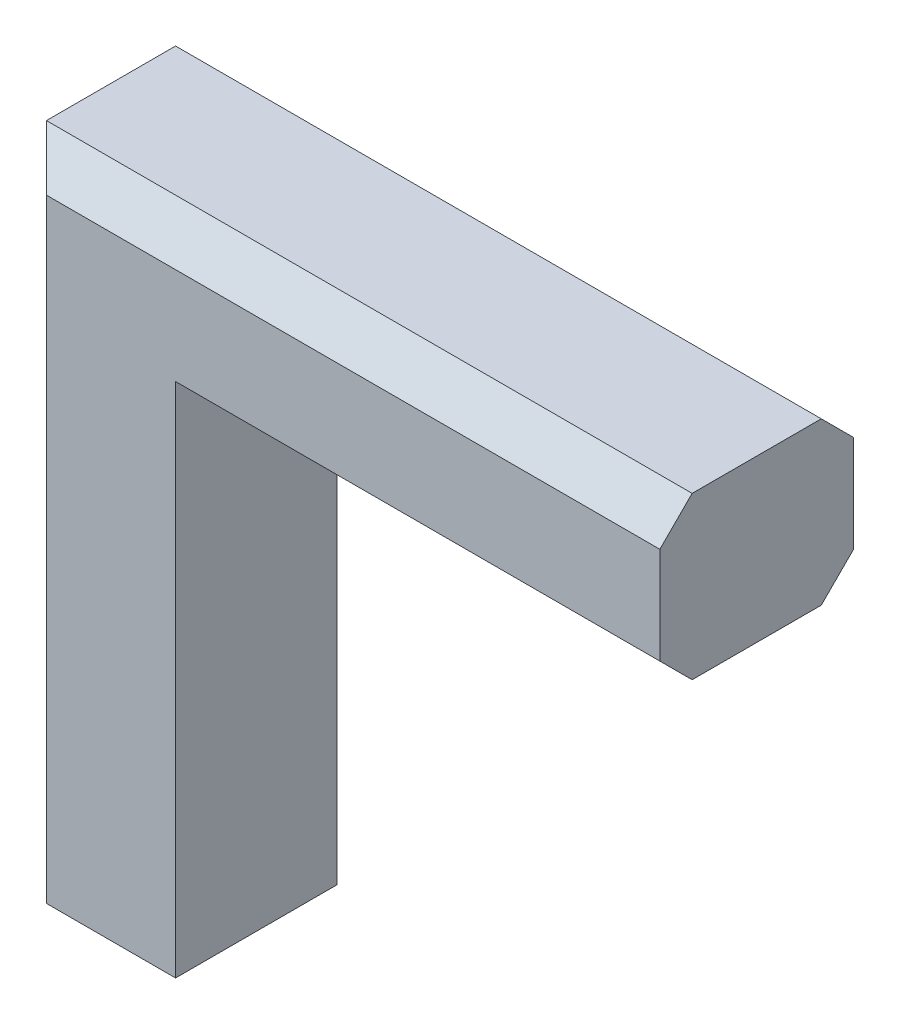
ISO-10303-21;
HEADER;
FILE_DESCRIPTION(('STEP AP214'),'2;1');
FILE_NAME('part.step','',(''),(''),'','','');
FILE_SCHEMA(('AUTOMOTIVE_DESIGN { 1 0 10303 214 1 1 1 1 }'));
ENDSEC;
DATA;
#1=APPLICATION_CONTEXT('core data for automotive mechanical design processes');
#2=APPLICATION_PROTOCOL_DEFINITION('international standard','automotive_design',2000,#1);
#3=PRODUCT_CONTEXT('',#1,'mechanical');
#4=PRODUCT('Part','Part','',(#3));
#5=PRODUCT_RELATED_PRODUCT_CATEGORY('part','',(#4));
#6=PRODUCT_DEFINITION_FORMATION('','',#4);
#7=PRODUCT_DEFINITION_CONTEXT('part definition',#1,'design');
#8=PRODUCT_DEFINITION('design','',#6,#7);
#9=PRODUCT_DEFINITION_SHAPE('','',#8);
#10=(LENGTH_UNIT() NAMED_UNIT(*) SI_UNIT(.MILLI.,.METRE.));
#11=(NAMED_UNIT(*) PLANE_ANGLE_UNIT() SI_UNIT($,.RADIAN.));
#12=(NAMED_UNIT(*) SI_UNIT($,.STERADIAN.) SOLID_ANGLE_UNIT());
#13=UNCERTAINTY_MEASURE_WITH_UNIT(LENGTH_MEASURE(1.E-05),#10,'distance_accuracy_value','');
#14=(GEOMETRIC_REPRESENTATION_CONTEXT(3) GLOBAL_UNCERTAINTY_ASSIGNED_CONTEXT((#13)) GLOBAL_UNIT_ASSIGNED_CONTEXT((#10,
#11,#12)) REPRESENTATION_CONTEXT('',''));
#15=CARTESIAN_POINT('',(0.,0.,0.));
#16=DIRECTION('',(0.,0.,1.));
#17=DIRECTION('',(1.,0.,0.));
#18=AXIS2_PLACEMENT_3D('',#15,#16,#17);
#19=CARTESIAN_POINT('',(0.5,-3.75,0.5));
#20=DIRECTION('',(-0.707106781186547,0.,-0.707106781186548));
#21=DIRECTION('',(-0.707106781186548,0.,0.707106781186547));
#22=AXIS2_PLACEMENT_3D('',#19,#20,#21);
#23=PLANE('',#22);
#24=DIRECTION('',(0.,1.,0.));
#25=VECTOR('',#24,1.);
#26=CARTESIAN_POINT('',(0.,0.,1.));
#27=LINE('',#26,#25);
#28=CARTESIAN_POINT('',(0.,5.,1.));
#29=VERTEX_POINT('',#28);
#30=CARTESIAN_POINT('',(0.,-15.,1.));
#31=VERTEX_POINT('',#30);
#32=EDGE_CURVE('E112',#29,#31,#27,.F.);
#33=ORIENTED_EDGE('',*,*,#32,.F.);
#34=DIRECTION('',(-0.577350269189626,0.577350269189626,0.577350269189625));
#35=VECTOR('',#34,1.);
#36=CARTESIAN_POINT('',(1.,4.,0.));
#37=LINE('',#36,#35);
#38=CARTESIAN_POINT('',(0.999999999999999,4.,0.));
#39=VERTEX_POINT('',#38);
#40=EDGE_CURVE('E106',#39,#29,#37,.T.);
#41=ORIENTED_EDGE('',*,*,#40,.F.);
#42=DIRECTION('',(0.,1.,0.));
#43=VECTOR('',#42,1.);
#44=CARTESIAN_POINT('',(1.,-7.5,0.));
#45=LINE('',#44,#43);
#46=CARTESIAN_POINT('',(1.,-15.,0.));
#47=VERTEX_POINT('',#46);
#48=EDGE_CURVE('E109',#39,#47,#45,.F.);
#49=ORIENTED_EDGE('',*,*,#48,.T.);
#50=DIRECTION('',(-0.707106781186548,0.,0.707106781186547));
#51=VECTOR('',#50,1.);
#52=CARTESIAN_POINT('',(0.5,-15.,0.5));
#53=LINE('',#52,#51);
#54=EDGE_CURVE('E19',#47,#31,#53,.T.);
#55=ORIENTED_EDGE('',*,*,#54,.T.);
#56=EDGE_LOOP('',(#33,#41,#49,#55));
#57=FACE_BOUND('',#56,.T.);
#58=ADVANCED_FACE('F16',(#57),#23,.T.);
#59=CARTESIAN_POINT('',(11.25,4.5,0.5));
#60=DIRECTION('',(0.,0.707106781186547,-0.707106781186548));
#61=DIRECTION('',(0.,0.707106781186548,0.707106781186547));
#62=AXIS2_PLACEMENT_3D('',#59,#60,#61);
#63=PLANE('',#62);
#64=DIRECTION('',(1.,0.,0.));
#65=VECTOR('',#64,1.);
#66=CARTESIAN_POINT('',(2.5,4.,0.));
#67=LINE('',#66,#65);
#68=CARTESIAN_POINT('',(20.,4.,0.));
#69=VERTEX_POINT('',#68);
#70=EDGE_CURVE('E121',#69,#39,#67,.F.);
#71=ORIENTED_EDGE('',*,*,#70,.T.);
#72=ORIENTED_EDGE('',*,*,#40,.T.);
#73=DIRECTION('',(1.,0.,0.));
#74=VECTOR('',#73,1.);
#75=CARTESIAN_POINT('',(20.,5.,1.));
#76=LINE('',#75,#74);
#77=CARTESIAN_POINT('',(20.,5.,1.));
#78=VERTEX_POINT('',#77);
#79=EDGE_CURVE('E195',#78,#29,#76,.F.);
#80=ORIENTED_EDGE('',*,*,#79,.F.);
#81=DIRECTION('',(0.,0.707106781186548,0.707106781186547));
#82=VECTOR('',#81,1.);
#83=CARTESIAN_POINT('',(20.,4.5,0.5));
#84=LINE('',#83,#82);
#85=EDGE_CURVE('E118',#78,#69,#84,.F.);
#86=ORIENTED_EDGE('',*,*,#85,.T.);
#87=EDGE_LOOP('',(#71,#72,#80,#86));
#88=FACE_BOUND('',#87,.T.);
#89=ADVANCED_FACE('F122',(#88),#63,.T.);
#90=CARTESIAN_POINT('',(1.25,0.5,0.5));
#91=DIRECTION('',(0.,-0.707106781186548,-0.707106781186547));
#92=DIRECTION('',(0.,0.707106781186547,-0.707106781186548));
#93=AXIS2_PLACEMENT_3D('',#90,#91,#92);
#94=PLANE('',#93);
#95=DIRECTION('',(1.,0.,0.));
#96=VECTOR('',#95,1.);
#97=CARTESIAN_POINT('',(0.,0.,1.));
#98=LINE('',#97,#96);
#99=CARTESIAN_POINT('',(5.,0.,1.));
#100=VERTEX_POINT('',#99);
#101=CARTESIAN_POINT('',(20.,0.,1.));
#102=VERTEX_POINT('',#101);
#103=EDGE_CURVE('E190',#100,#102,#98,.T.);
#104=ORIENTED_EDGE('',*,*,#103,.F.);
#105=DIRECTION('',(0.577350269189625,-0.577350269189626,0.577350269189626));
#106=VECTOR('',#105,1.);
#107=CARTESIAN_POINT('',(4.,1.,0.));
#108=LINE('',#107,#106);
#109=CARTESIAN_POINT('',(4.,1.,0.));
#110=VERTEX_POINT('',#109);
#111=EDGE_CURVE('E100',#110,#100,#108,.T.);
#112=ORIENTED_EDGE('',*,*,#111,.F.);
#113=DIRECTION('',(1.,0.,0.));
#114=VECTOR('',#113,1.);
#115=CARTESIAN_POINT('',(2.5,1.,0.));
#116=LINE('',#115,#114);
#117=CARTESIAN_POINT('',(20.,1.,0.));
#118=VERTEX_POINT('',#117);
#119=EDGE_CURVE('E138',#110,#118,#116,.T.);
#120=ORIENTED_EDGE('',*,*,#119,.T.);
#121=DIRECTION('',(0.,0.707106781186547,-0.707106781186548));
#122=VECTOR('',#121,1.);
#123=CARTESIAN_POINT('',(20.,0.5,0.5));
#124=LINE('',#123,#122);
#125=EDGE_CURVE('E117',#118,#102,#124,.F.);
#126=ORIENTED_EDGE('',*,*,#125,.T.);
#127=EDGE_LOOP('',(#104,#112,#120,#126));
#128=FACE_BOUND('',#127,.T.);
#129=ADVANCED_FACE('F199',(#128),#94,.T.);
#130=CARTESIAN_POINT('',(0.,0.,0.));
#131=DIRECTION('',(-1.,0.,0.));
#132=DIRECTION('',(0.,0.,1.));
#133=AXIS2_PLACEMENT_3D('',#130,#131,#132);
#134=PLANE('',#133);
#135=DIRECTION('',(0.,1.,0.));
#136=VECTOR('',#135,1.);
#137=CARTESIAN_POINT('',(0.,-3.75,5.));
#138=LINE('',#137,#136);
#139=CARTESIAN_POINT('',(0.,5.,5.));
#140=VERTEX_POINT('',#139);
#141=CARTESIAN_POINT('',(0.,-15.,5.));
#142=VERTEX_POINT('',#141);
#143=EDGE_CURVE('E179',#140,#142,#138,.F.);
#144=ORIENTED_EDGE('',*,*,#143,.F.);
#145=DIRECTION('',(0.,0.,1.));
#146=VECTOR('',#145,1.);
#147=CARTESIAN_POINT('',(0.,5.,0.));
#148=LINE('',#147,#146);
#149=EDGE_CURVE('E161',#29,#140,#148,.T.);
#150=ORIENTED_EDGE('',*,*,#149,.F.);
#151=ORIENTED_EDGE('',*,*,#32,.T.);
#152=DIRECTION('',(0.,0.,-1.));
#153=VECTOR('',#152,1.);
#154=CARTESIAN_POINT('',(0.,-15.,0.));
#155=LINE('',#154,#153);
#156=EDGE_CURVE('E159',#142,#31,#155,.T.);
#157=ORIENTED_EDGE('',*,*,#156,.F.);
#158=EDGE_LOOP('',(#144,#150,#151,#157));
#159=FACE_BOUND('',#158,.T.);
#160=ADVANCED_FACE('F158',(#159),#134,.T.);
#161=CARTESIAN_POINT('',(4.5,-11.25,0.5));
#162=DIRECTION('',(0.707106781186548,0.,-0.707106781186547));
#163=DIRECTION('',(-0.707106781186547,0.,-0.707106781186548));
#164=AXIS2_PLACEMENT_3D('',#161,#162,#163);
#165=PLANE('',#164);
#166=DIRECTION('',(0.,1.,0.));
#167=VECTOR('',#166,1.);
#168=CARTESIAN_POINT('',(4.,-7.5,0.));
#169=LINE('',#168,#167);
#170=CARTESIAN_POINT('',(4.,-15.,0.));
#171=VERTEX_POINT('',#170);
#172=EDGE_CURVE('E133',#171,#110,#169,.T.);
#173=ORIENTED_EDGE('',*,*,#172,.T.);
#174=ORIENTED_EDGE('',*,*,#111,.T.);
#175=DIRECTION('',(0.,1.,0.));
#176=VECTOR('',#175,1.);
#177=CARTESIAN_POINT('',(5.,-15.,1.));
#178=LINE('',#177,#176);
#179=CARTESIAN_POINT('',(5.,-15.,1.));
#180=VERTEX_POINT('',#179);
#181=EDGE_CURVE('E170',#180,#100,#178,.T.);
#182=ORIENTED_EDGE('',*,*,#181,.F.);
#183=DIRECTION('',(0.707106781186548,0.,0.707106781186548));
#184=VECTOR('',#183,1.);
#185=CARTESIAN_POINT('',(4.,-15.,0.));
#186=LINE('',#185,#184);
#187=EDGE_CURVE('E172',#171,#180,#186,.T.);
#188=ORIENTED_EDGE('',*,*,#187,.F.);
#189=EDGE_LOOP('',(#173,#174,#182,#188));
#190=FACE_BOUND('',#189,.T.);
#191=ADVANCED_FACE('F230',(#190),#165,.T.);
#192=CARTESIAN_POINT('',(2.5,-7.5,0.));
#193=DIRECTION('',(0.,0.,1.));
#194=DIRECTION('',(1.,0.,0.));
#195=AXIS2_PLACEMENT_3D('',#192,#193,#194);
#196=PLANE('',#195);
#197=ORIENTED_EDGE('',*,*,#172,.F.);
#198=DIRECTION('',(1.,0.,0.));
#199=VECTOR('',#198,1.);
#200=CARTESIAN_POINT('',(0.,-15.,0.));
#201=LINE('',#200,#199);
#202=EDGE_CURVE('E131',#47,#171,#201,.T.);
#203=ORIENTED_EDGE('',*,*,#202,.F.);
#204=ORIENTED_EDGE('',*,*,#48,.F.);
#205=ORIENTED_EDGE('',*,*,#70,.F.);
#206=DIRECTION('',(0.,1.,0.));
#207=VECTOR('',#206,1.);
#208=CARTESIAN_POINT('',(20.,0.,0.));
#209=LINE('',#208,#207);
#210=EDGE_CURVE('E200',#118,#69,#209,.T.);
#211=ORIENTED_EDGE('',*,*,#210,.F.);
#212=ORIENTED_EDGE('',*,*,#119,.F.);
#213=EDGE_LOOP('',(#197,#203,#204,#205,#211,#212));
#214=FACE_BOUND('',#213,.T.);
#215=ADVANCED_FACE('F129',(#214),#196,.F.);
#216=CARTESIAN_POINT('',(20.,5.,0.));
#217=DIRECTION('',(0.,1.,0.));
#218=DIRECTION('',(0.,0.,1.));
#219=AXIS2_PLACEMENT_3D('',#216,#217,#218);
#220=PLANE('',#219);
#221=ORIENTED_EDGE('',*,*,#79,.T.);
#222=ORIENTED_EDGE('',*,*,#149,.T.);
#223=DIRECTION('',(1.,0.,0.));
#224=VECTOR('',#223,1.);
#225=CARTESIAN_POINT('',(11.25,5.,5.));
#226=LINE('',#225,#224);
#227=CARTESIAN_POINT('',(20.,5.,5.));
#228=VERTEX_POINT('',#227);
#229=EDGE_CURVE('E186',#228,#140,#226,.F.);
#230=ORIENTED_EDGE('',*,*,#229,.F.);
#231=DIRECTION('',(0.,0.,-1.));
#232=VECTOR('',#231,1.);
#233=CARTESIAN_POINT('',(20.,5.,0.));
#234=LINE('',#233,#232);
#235=EDGE_CURVE('E203',#78,#228,#234,.F.);
#236=ORIENTED_EDGE('',*,*,#235,.F.);
#237=EDGE_LOOP('',(#221,#222,#230,#236));
#238=FACE_BOUND('',#237,.T.);
#239=ADVANCED_FACE('F271',(#238),#220,.T.);
#240=CARTESIAN_POINT('',(0.,0.,0.));
#241=DIRECTION('',(0.,-1.,0.));
#242=DIRECTION('',(0.,0.,-1.));
#243=AXIS2_PLACEMENT_3D('',#240,#241,#242);
#244=PLANE('',#243);
#245=DIRECTION('',(1.,0.,0.));
#246=VECTOR('',#245,1.);
#247=CARTESIAN_POINT('',(1.25,0.,5.));
#248=LINE('',#247,#246);
#249=CARTESIAN_POINT('',(5.,0.,5.));
#250=VERTEX_POINT('',#249);
#251=CARTESIAN_POINT('',(20.,0.,5.));
#252=VERTEX_POINT('',#251);
#253=EDGE_CURVE('E204',#250,#252,#248,.T.);
#254=ORIENTED_EDGE('',*,*,#253,.F.);
#255=DIRECTION('',(0.,0.,-1.));
#256=VECTOR('',#255,1.);
#257=CARTESIAN_POINT('',(5.,0.,0.));
#258=LINE('',#257,#256);
#259=EDGE_CURVE('E220',#100,#250,#258,.F.);
#260=ORIENTED_EDGE('',*,*,#259,.F.);
#261=ORIENTED_EDGE('',*,*,#103,.T.);
#262=DIRECTION('',(0.,0.,-1.));
#263=VECTOR('',#262,1.);
#264=CARTESIAN_POINT('',(20.,0.,0.));
#265=LINE('',#264,#263);
#266=EDGE_CURVE('E251',#252,#102,#265,.T.);
#267=ORIENTED_EDGE('',*,*,#266,.F.);
#268=EDGE_LOOP('',(#254,#260,#261,#267));
#269=FACE_BOUND('',#268,.T.);
#270=ADVANCED_FACE('F268',(#269),#244,.T.);
#271=CARTESIAN_POINT('',(11.25,4.5,5.5));
#272=DIRECTION('',(0.,0.707106781186547,0.707106781186548));
#273=DIRECTION('',(0.,-0.707106781186548,0.707106781186547));
#274=AXIS2_PLACEMENT_3D('',#271,#272,#273);
#275=PLANE('',#274);
#276=DIRECTION('',(0.,-0.707106781186548,0.707106781186548));
#277=VECTOR('',#276,1.);
#278=CARTESIAN_POINT('',(20.,5.,5.));
#279=LINE('',#278,#277);
#280=CARTESIAN_POINT('',(20.,4.,6.));
#281=VERTEX_POINT('',#280);
#282=EDGE_CURVE('E207',#228,#281,#279,.T.);
#283=ORIENTED_EDGE('',*,*,#282,.F.);
#284=ORIENTED_EDGE('',*,*,#229,.T.);
#285=DIRECTION('',(-0.577350269189626,0.577350269189626,-0.577350269189625));
#286=VECTOR('',#285,1.);
#287=CARTESIAN_POINT('',(1.,4.,6.));
#288=LINE('',#287,#286);
#289=CARTESIAN_POINT('',(1.,4.,6.));
#290=VERTEX_POINT('',#289);
#291=EDGE_CURVE('E182',#290,#140,#288,.T.);
#292=ORIENTED_EDGE('',*,*,#291,.F.);
#293=DIRECTION('',(1.,0.,0.));
#294=VECTOR('',#293,1.);
#295=CARTESIAN_POINT('',(2.5,4.,6.));
#296=LINE('',#295,#294);
#297=EDGE_CURVE('E246',#281,#290,#296,.F.);
#298=ORIENTED_EDGE('',*,*,#297,.F.);
#299=EDGE_LOOP('',(#283,#284,#292,#298));
#300=FACE_BOUND('',#299,.T.);
#301=ADVANCED_FACE('F270',(#300),#275,.T.);
#302=CARTESIAN_POINT('',(0.5,-3.75,5.5));
#303=DIRECTION('',(-0.707106781186547,0.,0.707106781186548));
#304=DIRECTION('',(0.707106781186548,0.,0.707106781186547));
#305=AXIS2_PLACEMENT_3D('',#302,#303,#304);
#306=PLANE('',#305);
#307=DIRECTION('',(-0.707106781186548,0.,-0.707106781186548));
#308=VECTOR('',#307,1.);
#309=CARTESIAN_POINT('',(1.,-15.,6.));
#310=LINE('',#309,#308);
#311=CARTESIAN_POINT('',(1.,-15.,6.));
#312=VERTEX_POINT('',#311);
#313=EDGE_CURVE('E165',#312,#142,#310,.T.);
#314=ORIENTED_EDGE('',*,*,#313,.F.);
#315=DIRECTION('',(0.,1.,0.));
#316=VECTOR('',#315,1.);
#317=CARTESIAN_POINT('',(1.,-7.5,6.));
#318=LINE('',#317,#316);
#319=EDGE_CURVE('E242',#290,#312,#318,.F.);
#320=ORIENTED_EDGE('',*,*,#319,.F.);
#321=ORIENTED_EDGE('',*,*,#291,.T.);
#322=ORIENTED_EDGE('',*,*,#143,.T.);
#323=EDGE_LOOP('',(#314,#320,#321,#322));
#324=FACE_BOUND('',#323,.T.);
#325=ADVANCED_FACE('F278',(#324),#306,.T.);
#326=CARTESIAN_POINT('',(0.,-15.,0.));
#327=DIRECTION('',(0.,-1.,0.));
#328=DIRECTION('',(0.,0.,-1.));
#329=AXIS2_PLACEMENT_3D('',#326,#327,#328);
#330=PLANE('',#329);
#331=ORIENTED_EDGE('',*,*,#54,.F.);
#332=ORIENTED_EDGE('',*,*,#202,.T.);
#333=ORIENTED_EDGE('',*,*,#187,.T.);
#334=DIRECTION('',(0.,0.,-1.));
#335=VECTOR('',#334,1.);
#336=CARTESIAN_POINT('',(5.,-15.,0.));
#337=LINE('',#336,#335);
#338=CARTESIAN_POINT('',(5.,-15.,6.));
#339=VERTEX_POINT('',#338);
#340=EDGE_CURVE('E216',#339,#180,#337,.T.);
#341=ORIENTED_EDGE('',*,*,#340,.F.);
#342=DIRECTION('',(1.,0.,0.));
#343=VECTOR('',#342,1.);
#344=CARTESIAN_POINT('',(2.5,-15.,6.));
#345=LINE('',#344,#343);
#346=EDGE_CURVE('E232',#312,#339,#345,.T.);
#347=ORIENTED_EDGE('',*,*,#346,.F.);
#348=ORIENTED_EDGE('',*,*,#313,.T.);
#349=ORIENTED_EDGE('',*,*,#156,.T.);
#350=EDGE_LOOP('',(#331,#332,#333,#341,#347,#348,#349));
#351=FACE_BOUND('',#350,.T.);
#352=ADVANCED_FACE('F163',(#351),#330,.T.);
#353=CARTESIAN_POINT('',(5.,-15.,0.));
#354=DIRECTION('',(1.,0.,0.));
#355=DIRECTION('',(0.,0.,-1.));
#356=AXIS2_PLACEMENT_3D('',#353,#354,#355);
#357=PLANE('',#356);
#358=DIRECTION('',(0.,1.,0.));
#359=VECTOR('',#358,1.);
#360=CARTESIAN_POINT('',(5.,-7.5,6.));
#361=LINE('',#360,#359);
#362=CARTESIAN_POINT('',(5.,1.,6.));
#363=VERTEX_POINT('',#362);
#364=EDGE_CURVE('E235',#339,#363,#361,.T.);
#365=ORIENTED_EDGE('',*,*,#364,.F.);
#366=ORIENTED_EDGE('',*,*,#340,.T.);
#367=ORIENTED_EDGE('',*,*,#181,.T.);
#368=ORIENTED_EDGE('',*,*,#259,.T.);
#369=DIRECTION('',(0.,-0.707106781186548,-0.707106781186547));
#370=VECTOR('',#369,1.);
#371=CARTESIAN_POINT('',(5.,0.5,5.5));
#372=LINE('',#371,#370);
#373=EDGE_CURVE('E210',#363,#250,#372,.T.);
#374=ORIENTED_EDGE('',*,*,#373,.F.);
#375=EDGE_LOOP('',(#365,#366,#367,#368,#374));
#376=FACE_BOUND('',#375,.T.);
#377=ADVANCED_FACE('F226',(#376),#357,.T.);
#378=CARTESIAN_POINT('',(1.25,0.5,5.5));
#379=DIRECTION('',(0.,-0.707106781186547,0.707106781186548));
#380=DIRECTION('',(0.,-0.707106781186548,-0.707106781186547));
#381=AXIS2_PLACEMENT_3D('',#378,#379,#380);
#382=PLANE('',#381);
#383=ORIENTED_EDGE('',*,*,#373,.T.);
#384=ORIENTED_EDGE('',*,*,#253,.T.);
#385=DIRECTION('',(0.,-0.707106781186548,-0.707106781186548));
#386=VECTOR('',#385,1.);
#387=CARTESIAN_POINT('',(20.,1.,6.));
#388=LINE('',#387,#386);
#389=CARTESIAN_POINT('',(20.,1.,6.));
#390=VERTEX_POINT('',#389);
#391=EDGE_CURVE('E35',#390,#252,#388,.T.);
#392=ORIENTED_EDGE('',*,*,#391,.F.);
#393=DIRECTION('',(1.,0.,0.));
#394=VECTOR('',#393,1.);
#395=CARTESIAN_POINT('',(2.5,1.,6.));
#396=LINE('',#395,#394);
#397=EDGE_CURVE('E26',#363,#390,#396,.T.);
#398=ORIENTED_EDGE('',*,*,#397,.F.);
#399=EDGE_LOOP('',(#383,#384,#392,#398));
#400=FACE_BOUND('',#399,.T.);
#401=ADVANCED_FACE('F265',(#400),#382,.T.);
#402=CARTESIAN_POINT('',(20.,0.,0.));
#403=DIRECTION('',(1.,0.,0.));
#404=DIRECTION('',(0.,0.,-1.));
#405=AXIS2_PLACEMENT_3D('',#402,#403,#404);
#406=PLANE('',#405);
#407=ORIENTED_EDGE('',*,*,#391,.T.);
#408=ORIENTED_EDGE('',*,*,#266,.T.);
#409=ORIENTED_EDGE('',*,*,#125,.F.);
#410=ORIENTED_EDGE('',*,*,#210,.T.);
#411=ORIENTED_EDGE('',*,*,#85,.F.);
#412=ORIENTED_EDGE('',*,*,#235,.T.);
#413=ORIENTED_EDGE('',*,*,#282,.T.);
#414=DIRECTION('',(0.,1.,0.));
#415=VECTOR('',#414,1.);
#416=CARTESIAN_POINT('',(20.,-7.5,6.));
#417=LINE('',#416,#415);
#418=EDGE_CURVE('E10',#390,#281,#417,.T.);
#419=ORIENTED_EDGE('',*,*,#418,.F.);
#420=EDGE_LOOP('',(#407,#408,#409,#410,#411,#412,#413,#419));
#421=FACE_BOUND('',#420,.T.);
#422=ADVANCED_FACE('F259',(#421),#406,.T.);
#423=CARTESIAN_POINT('',(2.5,-7.5,6.));
#424=DIRECTION('',(0.,0.,1.));
#425=DIRECTION('',(1.,0.,0.));
#426=AXIS2_PLACEMENT_3D('',#423,#424,#425);
#427=PLANE('',#426);
#428=ORIENTED_EDGE('',*,*,#397,.T.);
#429=ORIENTED_EDGE('',*,*,#418,.T.);
#430=ORIENTED_EDGE('',*,*,#297,.T.);
#431=ORIENTED_EDGE('',*,*,#319,.T.);
#432=ORIENTED_EDGE('',*,*,#346,.T.);
#433=ORIENTED_EDGE('',*,*,#364,.T.);
#434=EDGE_LOOP('',(#428,#429,#430,#431,#432,#433));
#435=FACE_BOUND('',#434,.T.);
#436=ADVANCED_FACE('F239',(#435),#427,.T.);
#437=CLOSED_SHELL('',(#58,#89,#129,#160,#191,#215,#239,#270,#301,#325,#352,#377,#401,#422,#436));
#438=MANIFOLD_SOLID_BREP('B1',#437);
#439=ADVANCED_BREP_SHAPE_REPRESENTATION('',(#18,#438),#14);
#440=SHAPE_DEFINITION_REPRESENTATION(#9,#439);
ENDSEC;
END-ISO-10303-21;
